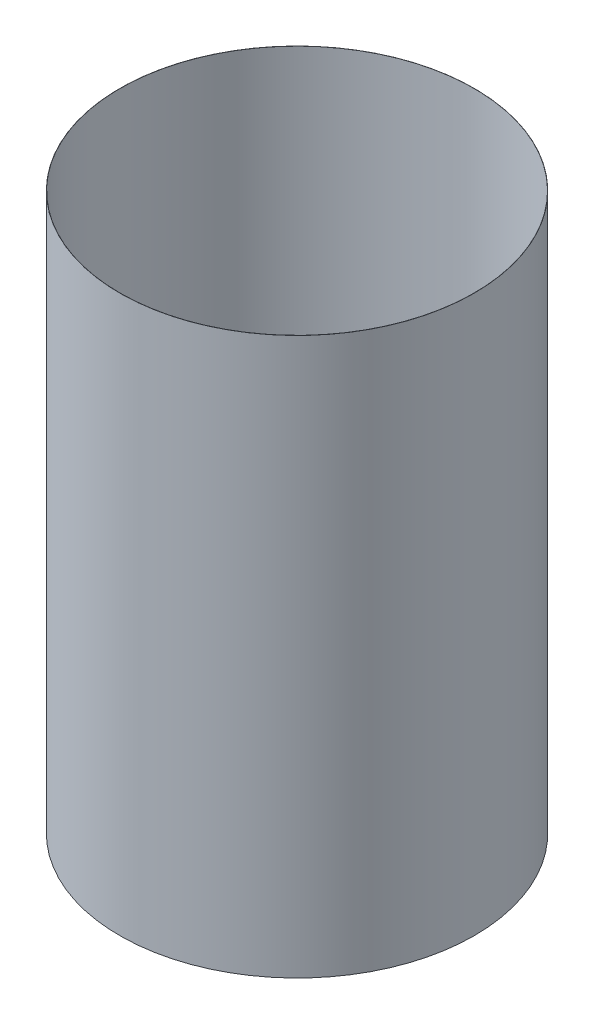
ISO-10303-21;
HEADER;
FILE_DESCRIPTION(('STEP AP214'),'2;1');
FILE_NAME('part.step','',(''),(''),'','','');
FILE_SCHEMA(('AUTOMOTIVE_DESIGN { 1 0 10303 214 1 1 1 1 }'));
ENDSEC;
DATA;
#1=APPLICATION_CONTEXT('core data for automotive mechanical design processes');
#2=APPLICATION_PROTOCOL_DEFINITION('international standard','automotive_design',2000,#1);
#3=PRODUCT_CONTEXT('',#1,'mechanical');
#4=PRODUCT('Part','Part','',(#3));
#5=PRODUCT_RELATED_PRODUCT_CATEGORY('part','',(#4));
#6=PRODUCT_DEFINITION_FORMATION('','',#4);
#7=PRODUCT_DEFINITION_CONTEXT('part definition',#1,'design');
#8=PRODUCT_DEFINITION('design','',#6,#7);
#9=PRODUCT_DEFINITION_SHAPE('','',#8);
#10=(LENGTH_UNIT() NAMED_UNIT(*) SI_UNIT(.MILLI.,.METRE.));
#11=(NAMED_UNIT(*) PLANE_ANGLE_UNIT() SI_UNIT($,.RADIAN.));
#12=(NAMED_UNIT(*) SI_UNIT($,.STERADIAN.) SOLID_ANGLE_UNIT());
#13=UNCERTAINTY_MEASURE_WITH_UNIT(LENGTH_MEASURE(1.E-05),#10,'distance_accuracy_value','');
#14=(GEOMETRIC_REPRESENTATION_CONTEXT(3) GLOBAL_UNCERTAINTY_ASSIGNED_CONTEXT((#13)) GLOBAL_UNIT_ASSIGNED_CONTEXT((#10,
#11,#12)) REPRESENTATION_CONTEXT('',''));
#15=CARTESIAN_POINT('',(0.,0.,0.));
#16=DIRECTION('',(0.,0.,1.));
#17=DIRECTION('',(1.,0.,0.));
#18=AXIS2_PLACEMENT_3D('',#15,#16,#17);
#19=CARTESIAN_POINT('',(0.,350.,0.));
#20=DIRECTION('',(0.,1.,0.));
#21=DIRECTION('',(0.,0.,1.));
#22=AXIS2_PLACEMENT_3D('',#19,#20,#21);
#23=PLANE('',#22);
#24=CARTESIAN_POINT('',(0.,350.,0.));
#25=DIRECTION('',(0.,1.,0.));
#26=DIRECTION('',(1.,0.,0.));
#27=AXIS2_PLACEMENT_3D('',#24,#25,#26);
#28=CIRCLE('',#27,111.508460165);
#29=CARTESIAN_POINT('',(111.508460165,350.,0.));
#30=VERTEX_POINT('',#29);
#31=EDGE_CURVE('E11',#30,#30,#28,.T.);
#32=ORIENTED_EDGE('',*,*,#31,.T.);
#33=EDGE_LOOP('',(#32));
#34=FACE_BOUND('',#33,.T.);
#35=CARTESIAN_POINT('',(0.,350.,0.));
#36=DIRECTION('',(0.,1.,0.));
#37=DIRECTION('',(0.,0.,1.));
#38=AXIS2_PLACEMENT_3D('',#35,#36,#37);
#39=CIRCLE('',#38,111.408460165);
#40=CARTESIAN_POINT('',(0.,350.,111.408460165));
#41=VERTEX_POINT('',#40);
#42=EDGE_CURVE('E48',#41,#41,#39,.T.);
#43=ORIENTED_EDGE('',*,*,#42,.F.);
#44=EDGE_LOOP('',(#43));
#45=FACE_BOUND('',#44,.T.);
#46=ADVANCED_FACE('F37',(#34,#45),#23,.T.);
#47=CARTESIAN_POINT('',(0.,0.,0.));
#48=DIRECTION('',(0.,1.,0.));
#49=DIRECTION('',(0.,0.,1.));
#50=AXIS2_PLACEMENT_3D('',#47,#48,#49);
#51=PLANE('',#50);
#52=CARTESIAN_POINT('',(0.,0.,0.));
#53=DIRECTION('',(0.,1.,0.));
#54=DIRECTION('',(1.,0.,0.));
#55=AXIS2_PLACEMENT_3D('',#52,#53,#54);
#56=CIRCLE('',#55,111.508460165);
#57=CARTESIAN_POINT('',(111.508460165,0.,0.));
#58=VERTEX_POINT('',#57);
#59=EDGE_CURVE('E41',#58,#58,#56,.T.);
#60=ORIENTED_EDGE('',*,*,#59,.F.);
#61=EDGE_LOOP('',(#60));
#62=FACE_BOUND('',#61,.T.);
#63=CARTESIAN_POINT('',(0.,0.,0.));
#64=DIRECTION('',(0.,1.,0.));
#65=DIRECTION('',(0.,0.,1.));
#66=AXIS2_PLACEMENT_3D('',#63,#64,#65);
#67=CIRCLE('',#66,111.408460165);
#68=CARTESIAN_POINT('',(0.,0.,111.408460165));
#69=VERTEX_POINT('',#68);
#70=EDGE_CURVE('E50',#69,#69,#67,.T.);
#71=ORIENTED_EDGE('',*,*,#70,.T.);
#72=EDGE_LOOP('',(#71));
#73=FACE_BOUND('',#72,.T.);
#74=ADVANCED_FACE('F60',(#62,#73),#51,.F.);
#75=CARTESIAN_POINT('',(0.,350.,0.));
#76=DIRECTION('',(0.,-1.,0.));
#77=DIRECTION('',(0.,0.,-1.));
#78=AXIS2_PLACEMENT_3D('',#75,#76,#77);
#79=CYLINDRICAL_SURFACE('',#78,111.508460165);
#80=ORIENTED_EDGE('',*,*,#31,.F.);
#81=EDGE_LOOP('',(#80));
#82=FACE_BOUND('',#81,.T.);
#83=ORIENTED_EDGE('',*,*,#59,.T.);
#84=EDGE_LOOP('',(#83));
#85=FACE_BOUND('',#84,.T.);
#86=ADVANCED_FACE('F39',(#82,#85),#79,.T.);
#87=CARTESIAN_POINT('',(0.,350.,0.));
#88=DIRECTION('',(0.,-1.,0.));
#89=DIRECTION('',(0.,0.,-1.));
#90=AXIS2_PLACEMENT_3D('',#87,#88,#89);
#91=CYLINDRICAL_SURFACE('',#90,111.408460165);
#92=ORIENTED_EDGE('',*,*,#42,.T.);
#93=EDGE_LOOP('',(#92));
#94=FACE_BOUND('',#93,.T.);
#95=ORIENTED_EDGE('',*,*,#70,.F.);
#96=EDGE_LOOP('',(#95));
#97=FACE_BOUND('',#96,.T.);
#98=ADVANCED_FACE('F56',(#94,#97),#91,.F.);
#99=CLOSED_SHELL('',(#46,#74,#86,#98));
#100=MANIFOLD_SOLID_BREP('B2',#99);
#101=ADVANCED_BREP_SHAPE_REPRESENTATION('',(#18,#100),#14);
#102=SHAPE_DEFINITION_REPRESENTATION(#9,#101);
ENDSEC;
END-ISO-10303-21;
